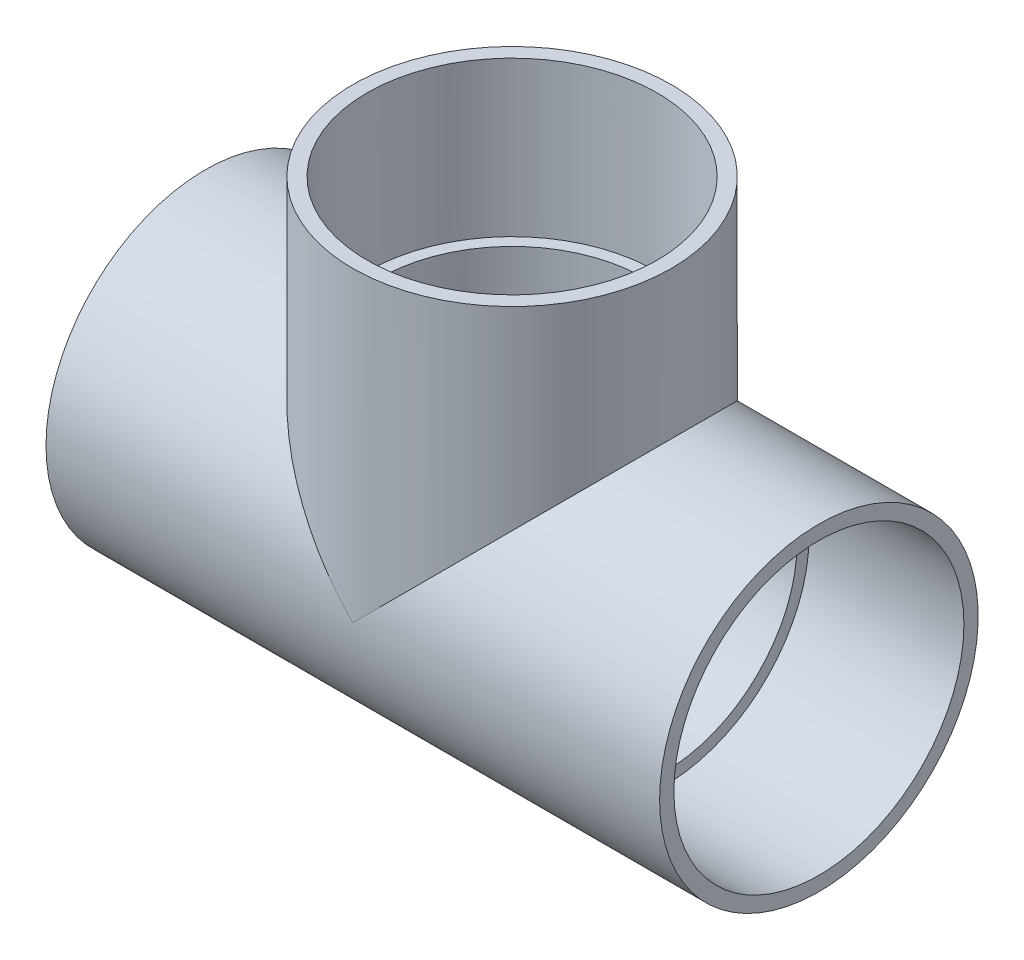
ISO-10303-21;
HEADER;
FILE_DESCRIPTION(('STEP AP214'),'2;1');
FILE_NAME('part.step','',(''),(''),'','','');
FILE_SCHEMA(('AUTOMOTIVE_DESIGN { 1 0 10303 214 1 1 1 1 }'));
ENDSEC;
DATA;
#1=APPLICATION_CONTEXT('core data for automotive mechanical design processes');
#2=APPLICATION_PROTOCOL_DEFINITION('international standard','automotive_design',2000,#1);
#3=PRODUCT_CONTEXT('',#1,'mechanical');
#4=PRODUCT('Part','Part','',(#3));
#5=PRODUCT_RELATED_PRODUCT_CATEGORY('part','',(#4));
#6=PRODUCT_DEFINITION_FORMATION('','',#4);
#7=PRODUCT_DEFINITION_CONTEXT('part definition',#1,'design');
#8=PRODUCT_DEFINITION('design','',#6,#7);
#9=PRODUCT_DEFINITION_SHAPE('','',#8);
#10=(LENGTH_UNIT() NAMED_UNIT(*) SI_UNIT(.MILLI.,.METRE.));
#11=(NAMED_UNIT(*) PLANE_ANGLE_UNIT() SI_UNIT($,.RADIAN.));
#12=(NAMED_UNIT(*) SI_UNIT($,.STERADIAN.) SOLID_ANGLE_UNIT());
#13=UNCERTAINTY_MEASURE_WITH_UNIT(LENGTH_MEASURE(1.E-05),#10,'distance_accuracy_value','');
#14=(GEOMETRIC_REPRESENTATION_CONTEXT(3) GLOBAL_UNCERTAINTY_ASSIGNED_CONTEXT((#13)) GLOBAL_UNIT_ASSIGNED_CONTEXT((#10,
#11,#12)) REPRESENTATION_CONTEXT('',''));
#15=CARTESIAN_POINT('',(0.,0.,0.));
#16=DIRECTION('',(0.,0.,1.));
#17=DIRECTION('',(1.,0.,0.));
#18=AXIS2_PLACEMENT_3D('',#15,#16,#17);
#19=CARTESIAN_POINT('',(-88.9,0.,0.));
#20=DIRECTION('',(1.,0.,0.));
#21=DIRECTION('',(0.,0.,-1.));
#22=AXIS2_PLACEMENT_3D('',#19,#20,#21);
#23=PLANE('',#22);
#24=CARTESIAN_POINT('',(-88.9,0.,0.));
#25=DIRECTION('',(-1.,0.,0.));
#26=DIRECTION('',(0.,0.,1.));
#27=AXIS2_PLACEMENT_3D('',#24,#25,#26);
#28=CIRCLE('',#27,83.9978);
#29=CARTESIAN_POINT('',(-88.9,0.,83.9978));
#30=VERTEX_POINT('',#29);
#31=EDGE_CURVE('E88',#30,#30,#28,.T.);
#32=ORIENTED_EDGE('',*,*,#31,.T.);
#33=EDGE_LOOP('',(#32));
#34=FACE_BOUND('',#33,.T.);
#35=CARTESIAN_POINT('',(-88.9,0.,0.));
#36=DIRECTION('',(1.,0.,0.));
#37=DIRECTION('',(0.,0.,-1.));
#38=AXIS2_PLACEMENT_3D('',#35,#36,#37);
#39=CIRCLE('',#38,77.0255);
#40=CARTESIAN_POINT('',(-88.9,0.,-77.0255));
#41=VERTEX_POINT('',#40);
#42=EDGE_CURVE('E71',#41,#41,#39,.T.);
#43=ORIENTED_EDGE('',*,*,#42,.T.);
#44=EDGE_LOOP('',(#43));
#45=FACE_BOUND('',#44,.T.);
#46=ADVANCED_FACE('F32',(#34,#45),#23,.F.);
#47=CARTESIAN_POINT('',(88.9,0.,0.));
#48=DIRECTION('',(1.,0.,0.));
#49=DIRECTION('',(0.,0.,-1.));
#50=AXIS2_PLACEMENT_3D('',#47,#48,#49);
#51=PLANE('',#50);
#52=CARTESIAN_POINT('',(88.9,0.,0.));
#53=DIRECTION('',(1.,0.,0.));
#54=DIRECTION('',(0.,0.,-1.));
#55=AXIS2_PLACEMENT_3D('',#52,#53,#54);
#56=CIRCLE('',#55,77.0255);
#57=CARTESIAN_POINT('',(88.9,0.,-77.0255));
#58=VERTEX_POINT('',#57);
#59=EDGE_CURVE('E68',#58,#58,#56,.T.);
#60=ORIENTED_EDGE('',*,*,#59,.F.);
#61=EDGE_LOOP('',(#60));
#62=FACE_BOUND('',#61,.T.);
#63=CARTESIAN_POINT('',(88.9,0.,0.));
#64=DIRECTION('',(1.,0.,0.));
#65=DIRECTION('',(0.,0.,-1.));
#66=AXIS2_PLACEMENT_3D('',#63,#64,#65);
#67=CIRCLE('',#66,83.9978);
#68=CARTESIAN_POINT('',(88.9,0.,-83.9978));
#69=VERTEX_POINT('',#68);
#70=EDGE_CURVE('E59',#69,#69,#67,.F.);
#71=ORIENTED_EDGE('',*,*,#70,.F.);
#72=EDGE_LOOP('',(#71));
#73=FACE_BOUND('',#72,.T.);
#74=ADVANCED_FACE('F110',(#62,#73),#51,.T.);
#75=CARTESIAN_POINT('',(88.9,0.,0.));
#76=DIRECTION('',(-1.,0.,0.));
#77=DIRECTION('',(0.,0.,1.));
#78=AXIS2_PLACEMENT_3D('',#75,#76,#77);
#79=CYLINDRICAL_SURFACE('',#78,92.71);
#80=CARTESIAN_POINT('',(-178.59375,0.,0.));
#81=DIRECTION('',(-1.,0.,0.));
#82=DIRECTION('',(0.,0.,1.));
#83=AXIS2_PLACEMENT_3D('',#80,#81,#82);
#84=CIRCLE('',#83,92.71);
#85=CARTESIAN_POINT('',(-178.59375,0.,92.71));
#86=VERTEX_POINT('',#85);
#87=EDGE_CURVE('E85',#86,#86,#84,.T.);
#88=ORIENTED_EDGE('',*,*,#87,.F.);
#89=EDGE_LOOP('',(#88));
#90=FACE_BOUND('',#89,.T.);
#91=CARTESIAN_POINT('',(178.59375,0.,0.));
#92=DIRECTION('',(-1.,0.,0.));
#93=DIRECTION('',(0.,0.,1.));
#94=AXIS2_PLACEMENT_3D('',#91,#92,#93);
#95=CIRCLE('',#94,92.71);
#96=CARTESIAN_POINT('',(178.59375,0.,92.71));
#97=VERTEX_POINT('',#96);
#98=EDGE_CURVE('E73',#97,#97,#95,.T.);
#99=ORIENTED_EDGE('',*,*,#98,.T.);
#100=EDGE_LOOP('',(#99));
#101=FACE_BOUND('',#100,.T.);
#102=CARTESIAN_POINT('',(0.,0.,0.));
#103=DIRECTION('',(-0.707106781186547,-0.707106781186548,0.));
#104=DIRECTION('',(0.707106781186547,-0.707106781186547,0.));
#105=AXIS2_PLACEMENT_3D('',#102,#103,#104);
#106=ELLIPSE('',#105,131.11173936761,92.71);
#107=CARTESIAN_POINT('',(0.,0.,92.71));
#108=VERTEX_POINT('',#107);
#109=CARTESIAN_POINT('',(0.,0.,-92.71));
#110=VERTEX_POINT('',#109);
#111=EDGE_CURVE('E94',#108,#110,#106,.T.);
#112=ORIENTED_EDGE('',*,*,#111,.T.);
#113=CARTESIAN_POINT('',(0.,0.,0.));
#114=DIRECTION('',(0.707106781186547,-0.707106781186547,0.));
#115=DIRECTION('',(-0.707106781186547,-0.707106781186548,0.));
#116=AXIS2_PLACEMENT_3D('',#113,#114,#115);
#117=ELLIPSE('',#116,131.11173936761,92.71);
#118=EDGE_CURVE('E51',#110,#108,#117,.T.);
#119=ORIENTED_EDGE('',*,*,#118,.T.);
#120=EDGE_LOOP('',(#112,#119));
#121=FACE_BOUND('',#120,.T.);
#122=ADVANCED_FACE('F112',(#90,#101,#121),#79,.T.);
#123=CARTESIAN_POINT('',(-88.9,0.,0.));
#124=DIRECTION('',(-1.,0.,0.));
#125=DIRECTION('',(0.,0.,1.));
#126=AXIS2_PLACEMENT_3D('',#123,#124,#125);
#127=CONICAL_SURFACE('',#126,83.9978,0.00467253236693876);
#128=CARTESIAN_POINT('',(-178.59375,0.,0.));
#129=DIRECTION('',(-1.,0.,0.));
#130=DIRECTION('',(0.,0.,1.));
#131=AXIS2_PLACEMENT_3D('',#128,#129,#130);
#132=CIRCLE('',#131,84.4169);
#133=CARTESIAN_POINT('',(-178.59375,0.,84.4169));
#134=VERTEX_POINT('',#133);
#135=EDGE_CURVE('E91',#134,#134,#132,.T.);
#136=ORIENTED_EDGE('',*,*,#135,.T.);
#137=EDGE_LOOP('',(#136));
#138=FACE_BOUND('',#137,.T.);
#139=ORIENTED_EDGE('',*,*,#31,.F.);
#140=EDGE_LOOP('',(#139));
#141=FACE_BOUND('',#140,.T.);
#142=ADVANCED_FACE('F119',(#138,#141),#127,.F.);
#143=CARTESIAN_POINT('',(178.59375,0.,0.));
#144=DIRECTION('',(1.,0.,0.));
#145=DIRECTION('',(0.,0.,-1.));
#146=AXIS2_PLACEMENT_3D('',#143,#144,#145);
#147=CONICAL_SURFACE('',#146,84.4169,0.0046725323669386);
#148=CARTESIAN_POINT('',(178.59375,0.,0.));
#149=DIRECTION('',(-1.,0.,0.));
#150=DIRECTION('',(0.,0.,1.));
#151=AXIS2_PLACEMENT_3D('',#148,#149,#150);
#152=CIRCLE('',#151,84.4169);
#153=CARTESIAN_POINT('',(178.59375,0.,84.4169));
#154=VERTEX_POINT('',#153);
#155=EDGE_CURVE('E76',#154,#154,#152,.T.);
#156=ORIENTED_EDGE('',*,*,#155,.F.);
#157=EDGE_LOOP('',(#156));
#158=FACE_BOUND('',#157,.T.);
#159=ORIENTED_EDGE('',*,*,#70,.T.);
#160=EDGE_LOOP('',(#159));
#161=FACE_BOUND('',#160,.T.);
#162=ADVANCED_FACE('F108',(#158,#161),#147,.F.);
#163=CARTESIAN_POINT('',(0.,178.59375,0.));
#164=DIRECTION('',(0.,1.,0.));
#165=DIRECTION('',(-1.,0.,0.));
#166=AXIS2_PLACEMENT_3D('',#163,#164,#165);
#167=CONICAL_SURFACE('',#166,84.4169,0.00467253236693875);
#168=CARTESIAN_POINT('',(0.,178.59375,0.));
#169=DIRECTION('',(0.,-1.,0.));
#170=DIRECTION('',(1.,0.,0.));
#171=AXIS2_PLACEMENT_3D('',#168,#169,#170);
#172=CIRCLE('',#171,84.4169);
#173=CARTESIAN_POINT('',(84.4169,178.59375,0.));
#174=VERTEX_POINT('',#173);
#175=EDGE_CURVE('E96',#174,#174,#172,.T.);
#176=ORIENTED_EDGE('',*,*,#175,.F.);
#177=EDGE_LOOP('',(#176));
#178=FACE_BOUND('',#177,.T.);
#179=CARTESIAN_POINT('',(0.,88.9,0.));
#180=DIRECTION('',(0.,-1.,0.));
#181=DIRECTION('',(1.,0.,0.));
#182=AXIS2_PLACEMENT_3D('',#179,#180,#181);
#183=CIRCLE('',#182,83.9978);
#184=CARTESIAN_POINT('',(83.9978,88.9,0.));
#185=VERTEX_POINT('',#184);
#186=EDGE_CURVE('E99',#185,#185,#183,.T.);
#187=ORIENTED_EDGE('',*,*,#186,.T.);
#188=EDGE_LOOP('',(#187));
#189=FACE_BOUND('',#188,.T.);
#190=ADVANCED_FACE('F128',(#178,#189),#167,.F.);
#191=CARTESIAN_POINT('',(92.71,178.59375,0.));
#192=DIRECTION('',(0.,1.,0.));
#193=DIRECTION('',(-1.,0.,0.));
#194=AXIS2_PLACEMENT_3D('',#191,#192,#193);
#195=PLANE('',#194);
#196=ORIENTED_EDGE('',*,*,#175,.T.);
#197=EDGE_LOOP('',(#196));
#198=FACE_BOUND('',#197,.T.);
#199=CARTESIAN_POINT('',(0.,178.59375,0.));
#200=DIRECTION('',(0.,-1.,0.));
#201=DIRECTION('',(1.,0.,0.));
#202=AXIS2_PLACEMENT_3D('',#199,#200,#201);
#203=CIRCLE('',#202,92.71);
#204=CARTESIAN_POINT('',(92.71,178.59375,0.));
#205=VERTEX_POINT('',#204);
#206=EDGE_CURVE('E102',#205,#205,#203,.T.);
#207=ORIENTED_EDGE('',*,*,#206,.F.);
#208=EDGE_LOOP('',(#207));
#209=FACE_BOUND('',#208,.T.);
#210=ADVANCED_FACE('F34',(#198,#209),#195,.T.);
#211=CARTESIAN_POINT('',(0.,0.,0.));
#212=DIRECTION('',(0.,-1.,0.));
#213=DIRECTION('',(1.,0.,0.));
#214=AXIS2_PLACEMENT_3D('',#211,#212,#213);
#215=CYLINDRICAL_SURFACE('',#214,92.71);
#216=ORIENTED_EDGE('',*,*,#118,.F.);
#217=ORIENTED_EDGE('',*,*,#111,.F.);
#218=EDGE_LOOP('',(#216,#217));
#219=FACE_BOUND('',#218,.T.);
#220=ORIENTED_EDGE('',*,*,#206,.T.);
#221=EDGE_LOOP('',(#220));
#222=FACE_BOUND('',#221,.T.);
#223=ADVANCED_FACE('F131',(#219,#222),#215,.T.);
#224=CARTESIAN_POINT('',(-178.59375,-92.71,0.));
#225=DIRECTION('',(-1.,0.,0.));
#226=DIRECTION('',(0.,0.,1.));
#227=AXIS2_PLACEMENT_3D('',#224,#225,#226);
#228=PLANE('',#227);
#229=ORIENTED_EDGE('',*,*,#87,.T.);
#230=EDGE_LOOP('',(#229));
#231=FACE_BOUND('',#230,.T.);
#232=ORIENTED_EDGE('',*,*,#135,.F.);
#233=EDGE_LOOP('',(#232));
#234=FACE_BOUND('',#233,.T.);
#235=ADVANCED_FACE('F125',(#231,#234),#228,.T.);
#236=CARTESIAN_POINT('',(178.59375,-92.71,0.));
#237=DIRECTION('',(1.,0.,0.));
#238=DIRECTION('',(0.,0.,-1.));
#239=AXIS2_PLACEMENT_3D('',#236,#237,#238);
#240=PLANE('',#239);
#241=ORIENTED_EDGE('',*,*,#155,.T.);
#242=EDGE_LOOP('',(#241));
#243=FACE_BOUND('',#242,.T.);
#244=ORIENTED_EDGE('',*,*,#98,.F.);
#245=EDGE_LOOP('',(#244));
#246=FACE_BOUND('',#245,.T.);
#247=ADVANCED_FACE('F137',(#243,#246),#240,.T.);
#248=CARTESIAN_POINT('',(0.,88.9,0.));
#249=DIRECTION('',(0.,-1.,0.));
#250=DIRECTION('',(1.,0.,0.));
#251=AXIS2_PLACEMENT_3D('',#248,#249,#250);
#252=PLANE('',#251);
#253=CARTESIAN_POINT('',(0.,88.9,0.));
#254=DIRECTION('',(0.,-1.,0.));
#255=DIRECTION('',(1.,0.,0.));
#256=AXIS2_PLACEMENT_3D('',#253,#254,#255);
#257=CIRCLE('',#256,77.0255);
#258=CARTESIAN_POINT('',(77.0255,88.9,0.));
#259=VERTEX_POINT('',#258);
#260=EDGE_CURVE('E78',#259,#259,#257,.T.);
#261=ORIENTED_EDGE('',*,*,#260,.T.);
#262=EDGE_LOOP('',(#261));
#263=FACE_BOUND('',#262,.T.);
#264=ORIENTED_EDGE('',*,*,#186,.F.);
#265=EDGE_LOOP('',(#264));
#266=FACE_BOUND('',#265,.T.);
#267=ADVANCED_FACE('F63',(#263,#266),#252,.F.);
#268=CARTESIAN_POINT('',(178.59375,0.,0.));
#269=DIRECTION('',(1.,0.,0.));
#270=DIRECTION('',(0.,0.,-1.));
#271=AXIS2_PLACEMENT_3D('',#268,#269,#270);
#272=CYLINDRICAL_SURFACE('',#271,77.0255);
#273=CARTESIAN_POINT('',(0.,0.,0.));
#274=DIRECTION('',(0.707106781186547,-0.707106781186547,0.));
#275=DIRECTION('',(0.707106781186547,0.707106781186547,0.));
#276=AXIS2_PLACEMENT_3D('',#273,#274,#275);
#277=ELLIPSE('',#276,108.930506748569,77.0255);
#278=CARTESIAN_POINT('',(0.,0.,-77.0255));
#279=VERTEX_POINT('',#278);
#280=CARTESIAN_POINT('',(0.,0.,77.0255));
#281=VERTEX_POINT('',#280);
#282=EDGE_CURVE('E11',#279,#281,#277,.T.);
#283=ORIENTED_EDGE('',*,*,#282,.F.);
#284=CARTESIAN_POINT('',(0.,0.,0.));
#285=DIRECTION('',(0.707106781186547,0.707106781186547,0.));
#286=DIRECTION('',(0.707106781186547,-0.707106781186547,0.));
#287=AXIS2_PLACEMENT_3D('',#284,#285,#286);
#288=ELLIPSE('',#287,108.930506748569,77.0255);
#289=EDGE_CURVE('E40',#281,#279,#288,.F.);
#290=ORIENTED_EDGE('',*,*,#289,.F.);
#291=EDGE_LOOP('',(#283,#290));
#292=FACE_BOUND('',#291,.T.);
#293=ORIENTED_EDGE('',*,*,#59,.T.);
#294=EDGE_LOOP('',(#293));
#295=FACE_BOUND('',#294,.T.);
#296=ORIENTED_EDGE('',*,*,#42,.F.);
#297=EDGE_LOOP('',(#296));
#298=FACE_BOUND('',#297,.T.);
#299=ADVANCED_FACE('F60',(#292,#295,#298),#272,.F.);
#300=CARTESIAN_POINT('',(0.,0.,0.));
#301=DIRECTION('',(0.,-1.,0.));
#302=DIRECTION('',(1.,0.,0.));
#303=AXIS2_PLACEMENT_3D('',#300,#301,#302);
#304=CYLINDRICAL_SURFACE('',#303,77.0255);
#305=ORIENTED_EDGE('',*,*,#282,.T.);
#306=ORIENTED_EDGE('',*,*,#289,.T.);
#307=EDGE_LOOP('',(#305,#306));
#308=FACE_BOUND('',#307,.T.);
#309=ORIENTED_EDGE('',*,*,#260,.F.);
#310=EDGE_LOOP('',(#309));
#311=FACE_BOUND('',#310,.T.);
#312=ADVANCED_FACE('F56',(#308,#311),#304,.F.);
#313=CLOSED_SHELL('',(#46,#74,#122,#142,#162,#190,#210,#223,#235,#247,#267,#299,#312));
#314=MANIFOLD_SOLID_BREP('B2',#313);
#315=ADVANCED_BREP_SHAPE_REPRESENTATION('',(#18,#314),#14);
#316=SHAPE_DEFINITION_REPRESENTATION(#9,#315);
ENDSEC;
END-ISO-10303-21;
